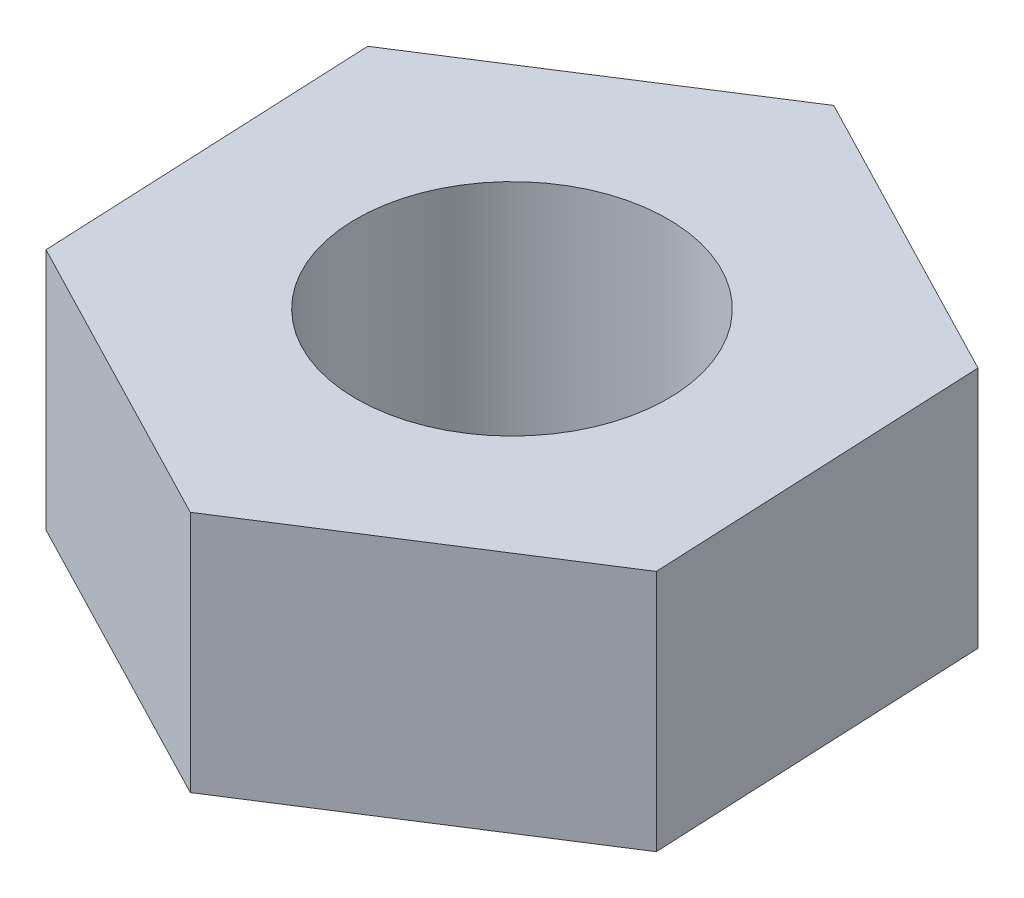
ISO-10303-21;
HEADER;
FILE_DESCRIPTION(('STEP AP214'),'2;1');
FILE_NAME('part.step','',(''),(''),'','','');
FILE_SCHEMA(('AUTOMOTIVE_DESIGN { 1 0 10303 214 1 1 1 1 }'));
ENDSEC;
DATA;
#1=APPLICATION_CONTEXT('core data for automotive mechanical design processes');
#2=APPLICATION_PROTOCOL_DEFINITION('international standard','automotive_design',2000,#1);
#3=PRODUCT_CONTEXT('',#1,'mechanical');
#4=PRODUCT('Part','Part','',(#3));
#5=PRODUCT_RELATED_PRODUCT_CATEGORY('part','',(#4));
#6=PRODUCT_DEFINITION_FORMATION('','',#4);
#7=PRODUCT_DEFINITION_CONTEXT('part definition',#1,'design');
#8=PRODUCT_DEFINITION('design','',#6,#7);
#9=PRODUCT_DEFINITION_SHAPE('','',#8);
#10=(LENGTH_UNIT() NAMED_UNIT(*) SI_UNIT(.MILLI.,.METRE.));
#11=(NAMED_UNIT(*) PLANE_ANGLE_UNIT() SI_UNIT($,.RADIAN.));
#12=(NAMED_UNIT(*) SI_UNIT($,.STERADIAN.) SOLID_ANGLE_UNIT());
#13=UNCERTAINTY_MEASURE_WITH_UNIT(LENGTH_MEASURE(1.E-05),#10,'distance_accuracy_value','');
#14=(GEOMETRIC_REPRESENTATION_CONTEXT(3) GLOBAL_UNCERTAINTY_ASSIGNED_CONTEXT((#13)) GLOBAL_UNIT_ASSIGNED_CONTEXT((#10,
#11,#12)) REPRESENTATION_CONTEXT('',''));
#15=CARTESIAN_POINT('',(0.,0.,0.));
#16=DIRECTION('',(0.,0.,1.));
#17=DIRECTION('',(1.,0.,0.));
#18=AXIS2_PLACEMENT_3D('',#15,#16,#17);
#19=CARTESIAN_POINT('',(4.99775002343664,2.025,2.59036574700155));
#20=DIRECTION('',(-0.998968982271937,0.,0.0453979345187786));
#21=DIRECTION('',(0.0453979345187786,0.,0.998968982271937));
#22=AXIS2_PLACEMENT_3D('',#19,#20,#21);
#23=PLANE('',#22);
#24=DIRECTION('',(-0.0453979345187786,0.,-0.998968982271937));
#25=VECTOR('',#24,1.);
#26=CARTESIAN_POINT('',(4.99775002343664,-2.025,2.59036574700155));
#27=LINE('',#26,#25);
#28=CARTESIAN_POINT('',(4.99775002343664,-2.025,2.59036574700155));
#29=VERTEX_POINT('',#28);
#30=CARTESIAN_POINT('',(4.74219755371471,-2.025,-3.03299560855962));
#31=VERTEX_POINT('',#30);
#32=EDGE_CURVE('E117',#29,#31,#27,.T.);
#33=ORIENTED_EDGE('',*,*,#32,.T.);
#34=DIRECTION('',(0.,-1.,0.));
#35=VECTOR('',#34,1.);
#36=CARTESIAN_POINT('',(4.74219755371471,2.025,-3.03299560855962));
#37=LINE('',#36,#35);
#38=CARTESIAN_POINT('',(4.74219755371471,2.025,-3.03299560855962));
#39=VERTEX_POINT('',#38);
#40=EDGE_CURVE('E11',#39,#31,#37,.T.);
#41=ORIENTED_EDGE('',*,*,#40,.F.);
#42=DIRECTION('',(-0.0453979345187786,0.,-0.998968982271937));
#43=VECTOR('',#42,1.);
#44=CARTESIAN_POINT('',(4.99775002343664,2.025,2.59036574700155));
#45=LINE('',#44,#43);
#46=CARTESIAN_POINT('',(4.99775002343664,2.025,2.59036574700155));
#47=VERTEX_POINT('',#46);
#48=EDGE_CURVE('E128',#47,#39,#45,.T.);
#49=ORIENTED_EDGE('',*,*,#48,.F.);
#50=DIRECTION('',(0.,-1.,0.));
#51=VECTOR('',#50,1.);
#52=CARTESIAN_POINT('',(4.99775002343664,2.025,2.59036574700155));
#53=LINE('',#52,#51);
#54=EDGE_CURVE('E113',#47,#29,#53,.T.);
#55=ORIENTED_EDGE('',*,*,#54,.T.);
#56=EDGE_LOOP('',(#33,#41,#49,#55));
#57=FACE_BOUND('',#56,.T.);
#58=ADVANCED_FACE('F33',(#57),#23,.F.);
#59=CARTESIAN_POINT('',(4.74219755371471,2.025,-3.03299560855962));
#60=DIRECTION('',(-0.460168726563365,0.,0.887831483499572));
#61=DIRECTION('',(0.887831483499572,0.,0.460168726563365));
#62=AXIS2_PLACEMENT_3D('',#59,#60,#61);
#63=PLANE('',#62);
#64=DIRECTION('',(-0.887831483499572,0.,-0.460168726563365));
#65=VECTOR('',#64,1.);
#66=CARTESIAN_POINT('',(4.74219755371471,-2.025,-3.03299560855962));
#67=LINE('',#66,#65);
#68=CARTESIAN_POINT('',(-0.255552469721922,-2.025,-5.62336135556117));
#69=VERTEX_POINT('',#68);
#70=EDGE_CURVE('E120',#31,#69,#67,.T.);
#71=ORIENTED_EDGE('',*,*,#70,.T.);
#72=DIRECTION('',(0.,-1.,0.));
#73=VECTOR('',#72,1.);
#74=CARTESIAN_POINT('',(-0.255552469721922,2.025,-5.62336135556117));
#75=LINE('',#74,#73);
#76=CARTESIAN_POINT('',(-0.255552469721922,2.025,-5.62336135556117));
#77=VERTEX_POINT('',#76);
#78=EDGE_CURVE('E41',#77,#69,#75,.T.);
#79=ORIENTED_EDGE('',*,*,#78,.F.);
#80=DIRECTION('',(-0.887831483499572,0.,-0.460168726563365));
#81=VECTOR('',#80,1.);
#82=CARTESIAN_POINT('',(4.74219755371471,2.025,-3.03299560855962));
#83=LINE('',#82,#81);
#84=EDGE_CURVE('E86',#39,#77,#83,.T.);
#85=ORIENTED_EDGE('',*,*,#84,.F.);
#86=ORIENTED_EDGE('',*,*,#40,.T.);
#87=EDGE_LOOP('',(#71,#79,#85,#86));
#88=FACE_BOUND('',#87,.T.);
#89=ADVANCED_FACE('F153',(#88),#63,.F.);
#90=CARTESIAN_POINT('',(-0.255552469721922,2.025,-5.62336135556117));
#91=DIRECTION('',(0.538800255708572,0.,0.842433548980795));
#92=DIRECTION('',(0.842433548980795,0.,-0.538800255708572));
#93=AXIS2_PLACEMENT_3D('',#90,#91,#92);
#94=PLANE('',#93);
#95=DIRECTION('',(-0.842433548980795,0.,0.538800255708572));
#96=VECTOR('',#95,1.);
#97=CARTESIAN_POINT('',(-0.255552469721922,-2.025,-5.62336135556117));
#98=LINE('',#97,#96);
#99=CARTESIAN_POINT('',(-4.99775002343663,-2.025,-2.59036574700154));
#100=VERTEX_POINT('',#99);
#101=EDGE_CURVE('E123',#69,#100,#98,.T.);
#102=ORIENTED_EDGE('',*,*,#101,.T.);
#103=DIRECTION('',(0.,-1.,0.));
#104=VECTOR('',#103,1.);
#105=CARTESIAN_POINT('',(-4.99775002343663,2.025,-2.59036574700154));
#106=LINE('',#105,#104);
#107=CARTESIAN_POINT('',(-4.99775002343663,2.025,-2.59036574700154));
#108=VERTEX_POINT('',#107);
#109=EDGE_CURVE('E108',#108,#100,#106,.T.);
#110=ORIENTED_EDGE('',*,*,#109,.F.);
#111=DIRECTION('',(-0.842433548980795,0.,0.538800255708572));
#112=VECTOR('',#111,1.);
#113=CARTESIAN_POINT('',(-0.255552469721922,2.025,-5.62336135556117));
#114=LINE('',#113,#112);
#115=EDGE_CURVE('E99',#77,#108,#114,.T.);
#116=ORIENTED_EDGE('',*,*,#115,.F.);
#117=ORIENTED_EDGE('',*,*,#78,.T.);
#118=EDGE_LOOP('',(#102,#110,#116,#117));
#119=FACE_BOUND('',#118,.T.);
#120=ADVANCED_FACE('F134',(#119),#94,.F.);
#121=CARTESIAN_POINT('',(-4.99775002343663,2.025,-2.59036574700154));
#122=DIRECTION('',(0.998968982271937,0.,-0.0453979345187775));
#123=DIRECTION('',(-0.0453979345187775,0.,-0.998968982271937));
#124=AXIS2_PLACEMENT_3D('',#121,#122,#123);
#125=PLANE('',#124);
#126=DIRECTION('',(0.0453979345187775,0.,0.998968982271937));
#127=VECTOR('',#126,1.);
#128=CARTESIAN_POINT('',(-4.99775002343663,-2.025,-2.59036574700154));
#129=LINE('',#128,#127);
#130=CARTESIAN_POINT('',(-4.74219755371471,-2.025,3.03299560855963));
#131=VERTEX_POINT('',#130);
#132=EDGE_CURVE('E107',#100,#131,#129,.T.);
#133=ORIENTED_EDGE('',*,*,#132,.T.);
#134=DIRECTION('',(0.,-1.,0.));
#135=VECTOR('',#134,1.);
#136=CARTESIAN_POINT('',(-4.74219755371471,2.025,3.03299560855963));
#137=LINE('',#136,#135);
#138=CARTESIAN_POINT('',(-4.74219755371471,2.025,3.03299560855963));
#139=VERTEX_POINT('',#138);
#140=EDGE_CURVE('E104',#139,#131,#137,.T.);
#141=ORIENTED_EDGE('',*,*,#140,.F.);
#142=DIRECTION('',(0.0453979345187775,0.,0.998968982271937));
#143=VECTOR('',#142,1.);
#144=CARTESIAN_POINT('',(-4.99775002343663,2.025,-2.59036574700154));
#145=LINE('',#144,#143);
#146=EDGE_CURVE('E93',#108,#139,#145,.T.);
#147=ORIENTED_EDGE('',*,*,#146,.F.);
#148=ORIENTED_EDGE('',*,*,#109,.T.);
#149=EDGE_LOOP('',(#133,#141,#147,#148));
#150=FACE_BOUND('',#149,.T.);
#151=ADVANCED_FACE('F105',(#150),#125,.F.);
#152=CARTESIAN_POINT('',(-4.74219755371471,2.025,3.03299560855963));
#153=DIRECTION('',(0.460168726563365,0.,-0.887831483499572));
#154=DIRECTION('',(-0.887831483499572,0.,-0.460168726563365));
#155=AXIS2_PLACEMENT_3D('',#152,#153,#154);
#156=PLANE('',#155);
#157=DIRECTION('',(0.887831483499572,0.,0.460168726563365));
#158=VECTOR('',#157,1.);
#159=CARTESIAN_POINT('',(-4.74219755371471,-2.025,3.03299560855963));
#160=LINE('',#159,#158);
#161=CARTESIAN_POINT('',(0.255552469721917,-2.025,5.62336135556118));
#162=VERTEX_POINT('',#161);
#163=EDGE_CURVE('E72',#131,#162,#160,.T.);
#164=ORIENTED_EDGE('',*,*,#163,.T.);
#165=DIRECTION('',(0.,-1.,0.));
#166=VECTOR('',#165,1.);
#167=CARTESIAN_POINT('',(0.255552469721917,2.025,5.62336135556118));
#168=LINE('',#167,#166);
#169=CARTESIAN_POINT('',(0.255552469721917,2.025,5.62336135556118));
#170=VERTEX_POINT('',#169);
#171=EDGE_CURVE('E109',#170,#162,#168,.T.);
#172=ORIENTED_EDGE('',*,*,#171,.F.);
#173=DIRECTION('',(0.887831483499572,0.,0.460168726563365));
#174=VECTOR('',#173,1.);
#175=CARTESIAN_POINT('',(-4.74219755371471,2.025,3.03299560855963));
#176=LINE('',#175,#174);
#177=EDGE_CURVE('E97',#139,#170,#176,.T.);
#178=ORIENTED_EDGE('',*,*,#177,.F.);
#179=ORIENTED_EDGE('',*,*,#140,.T.);
#180=EDGE_LOOP('',(#164,#172,#178,#179));
#181=FACE_BOUND('',#180,.T.);
#182=ADVANCED_FACE('F111',(#181),#156,.F.);
#183=CARTESIAN_POINT('',(0.255552469721917,2.025,5.62336135556118));
#184=DIRECTION('',(-0.538800255708572,0.,-0.842433548980795));
#185=DIRECTION('',(-0.842433548980795,0.,0.538800255708572));
#186=AXIS2_PLACEMENT_3D('',#183,#184,#185);
#187=PLANE('',#186);
#188=DIRECTION('',(0.842433548980795,0.,-0.538800255708572));
#189=VECTOR('',#188,1.);
#190=CARTESIAN_POINT('',(0.255552469721917,-2.025,5.62336135556118));
#191=LINE('',#190,#189);
#192=EDGE_CURVE('E78',#162,#29,#191,.T.);
#193=ORIENTED_EDGE('',*,*,#192,.T.);
#194=ORIENTED_EDGE('',*,*,#54,.F.);
#195=DIRECTION('',(0.842433548980795,0.,-0.538800255708572));
#196=VECTOR('',#195,1.);
#197=CARTESIAN_POINT('',(0.255552469721917,2.025,5.62336135556118));
#198=LINE('',#197,#196);
#199=EDGE_CURVE('E49',#170,#47,#198,.T.);
#200=ORIENTED_EDGE('',*,*,#199,.F.);
#201=ORIENTED_EDGE('',*,*,#171,.T.);
#202=EDGE_LOOP('',(#193,#194,#200,#201));
#203=FACE_BOUND('',#202,.T.);
#204=ADVANCED_FACE('F141',(#203),#187,.F.);
#205=CARTESIAN_POINT('',(0.,2.025,0.));
#206=DIRECTION('',(0.,1.,0.));
#207=DIRECTION('',(0.,0.,1.));
#208=AXIS2_PLACEMENT_3D('',#205,#206,#207);
#209=PLANE('',#208);
#210=CARTESIAN_POINT('',(0.,2.025,0.));
#211=DIRECTION('',(0.,1.,0.));
#212=DIRECTION('',(0.,0.,1.));
#213=AXIS2_PLACEMENT_3D('',#210,#211,#212);
#214=CIRCLE('',#213,2.6);
#215=CARTESIAN_POINT('',(0.,2.025,2.6));
#216=VERTEX_POINT('',#215);
#217=EDGE_CURVE('E206',#216,#216,#214,.T.);
#218=ORIENTED_EDGE('',*,*,#217,.F.);
#219=EDGE_LOOP('',(#218));
#220=FACE_BOUND('',#219,.T.);
#221=ORIENTED_EDGE('',*,*,#48,.T.);
#222=ORIENTED_EDGE('',*,*,#84,.T.);
#223=ORIENTED_EDGE('',*,*,#115,.T.);
#224=ORIENTED_EDGE('',*,*,#146,.T.);
#225=ORIENTED_EDGE('',*,*,#177,.T.);
#226=ORIENTED_EDGE('',*,*,#199,.T.);
#227=EDGE_LOOP('',(#221,#222,#223,#224,#225,#226));
#228=FACE_BOUND('',#227,.T.);
#229=ADVANCED_FACE('F95',(#220,#228),#209,.T.);
#230=CARTESIAN_POINT('',(0.,-2.025,0.));
#231=DIRECTION('',(0.,1.,0.));
#232=DIRECTION('',(0.,0.,1.));
#233=AXIS2_PLACEMENT_3D('',#230,#231,#232);
#234=PLANE('',#233);
#235=CARTESIAN_POINT('',(0.,-2.025,0.));
#236=DIRECTION('',(0.,1.,0.));
#237=DIRECTION('',(0.,0.,1.));
#238=AXIS2_PLACEMENT_3D('',#235,#236,#237);
#239=CIRCLE('',#238,2.6);
#240=CARTESIAN_POINT('',(0.,-2.025,2.6));
#241=VERTEX_POINT('',#240);
#242=EDGE_CURVE('E121',#241,#241,#239,.F.);
#243=ORIENTED_EDGE('',*,*,#242,.F.);
#244=EDGE_LOOP('',(#243));
#245=FACE_BOUND('',#244,.T.);
#246=ORIENTED_EDGE('',*,*,#32,.F.);
#247=ORIENTED_EDGE('',*,*,#192,.F.);
#248=ORIENTED_EDGE('',*,*,#163,.F.);
#249=ORIENTED_EDGE('',*,*,#132,.F.);
#250=ORIENTED_EDGE('',*,*,#101,.F.);
#251=ORIENTED_EDGE('',*,*,#70,.F.);
#252=EDGE_LOOP('',(#246,#247,#248,#249,#250,#251));
#253=FACE_BOUND('',#252,.T.);
#254=ADVANCED_FACE('F137',(#245,#253),#234,.F.);
#255=CARTESIAN_POINT('',(0.,-2.026,0.));
#256=DIRECTION('',(0.,1.,0.));
#257=DIRECTION('',(0.,0.,1.));
#258=AXIS2_PLACEMENT_3D('',#255,#256,#257);
#259=CYLINDRICAL_SURFACE('',#258,2.6);
#260=ORIENTED_EDGE('',*,*,#217,.T.);
#261=EDGE_LOOP('',(#260));
#262=FACE_BOUND('',#261,.T.);
#263=ORIENTED_EDGE('',*,*,#242,.T.);
#264=EDGE_LOOP('',(#263));
#265=FACE_BOUND('',#264,.T.);
#266=ADVANCED_FACE('F190',(#262,#265),#259,.F.);
#267=CLOSED_SHELL('',(#58,#89,#120,#151,#182,#204,#229,#254,#266));
#268=MANIFOLD_SOLID_BREP('B2',#267);
#269=ADVANCED_BREP_SHAPE_REPRESENTATION('',(#18,#268),#14);
#270=SHAPE_DEFINITION_REPRESENTATION(#9,#269);
ENDSEC;
END-ISO-10303-21;
